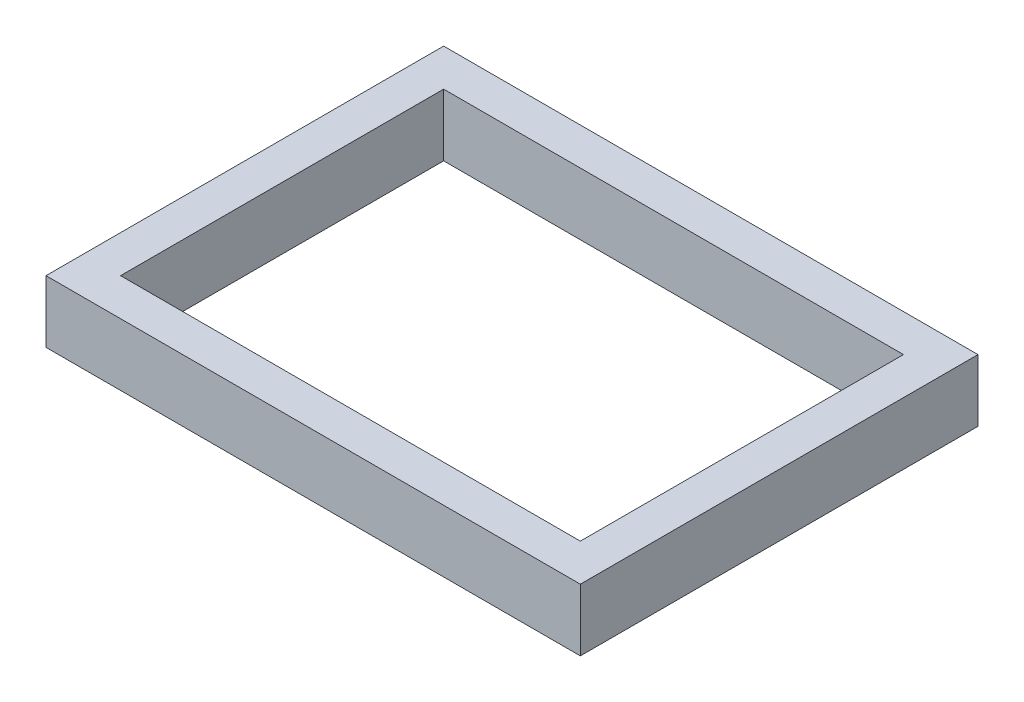
ISO-10303-21;
HEADER;
FILE_DESCRIPTION(('STEP AP214'),'2;1');
FILE_NAME('part.step','',(''),(''),'','','');
FILE_SCHEMA(('AUTOMOTIVE_DESIGN { 1 0 10303 214 1 1 1 1 }'));
ENDSEC;
DATA;
#1=APPLICATION_CONTEXT('core data for automotive mechanical design processes');
#2=APPLICATION_PROTOCOL_DEFINITION('international standard','automotive_design',2000,#1);
#3=PRODUCT_CONTEXT('',#1,'mechanical');
#4=PRODUCT('Part','Part','',(#3));
#5=PRODUCT_RELATED_PRODUCT_CATEGORY('part','',(#4));
#6=PRODUCT_DEFINITION_FORMATION('','',#4);
#7=PRODUCT_DEFINITION_CONTEXT('part definition',#1,'design');
#8=PRODUCT_DEFINITION('design','',#6,#7);
#9=PRODUCT_DEFINITION_SHAPE('','',#8);
#10=(LENGTH_UNIT() NAMED_UNIT(*) SI_UNIT(.MILLI.,.METRE.));
#11=(NAMED_UNIT(*) PLANE_ANGLE_UNIT() SI_UNIT($,.RADIAN.));
#12=(NAMED_UNIT(*) SI_UNIT($,.STERADIAN.) SOLID_ANGLE_UNIT());
#13=UNCERTAINTY_MEASURE_WITH_UNIT(LENGTH_MEASURE(1.E-05),#10,'distance_accuracy_value','');
#14=(GEOMETRIC_REPRESENTATION_CONTEXT(3) GLOBAL_UNCERTAINTY_ASSIGNED_CONTEXT((#13)) GLOBAL_UNIT_ASSIGNED_CONTEXT((#10,
#11,#12)) REPRESENTATION_CONTEXT('',''));
#15=CARTESIAN_POINT('',(0.,0.,0.));
#16=DIRECTION('',(0.,0.,1.));
#17=DIRECTION('',(1.,0.,0.));
#18=AXIS2_PLACEMENT_3D('',#15,#16,#17);
#19=CARTESIAN_POINT('',(0.,5.,0.));
#20=DIRECTION('',(0.,-1.,0.));
#21=DIRECTION('',(0.,0.,-1.));
#22=AXIS2_PLACEMENT_3D('',#19,#20,#21);
#23=PLANE('',#22);
#24=DIRECTION('',(0.,0.,1.));
#25=VECTOR('',#24,1.);
#26=CARTESIAN_POINT('',(-3.,5.,3.));
#27=LINE('',#26,#25);
#28=CARTESIAN_POINT('',(-3.,5.,-29.));
#29=VERTEX_POINT('',#28);
#30=CARTESIAN_POINT('',(-3.,5.,3.));
#31=VERTEX_POINT('',#30);
#32=EDGE_CURVE('E134',#29,#31,#27,.T.);
#33=ORIENTED_EDGE('',*,*,#32,.T.);
#34=DIRECTION('',(1.,0.,0.));
#35=VECTOR('',#34,1.);
#36=CARTESIAN_POINT('',(-3.,5.,3.));
#37=LINE('',#36,#35);
#38=CARTESIAN_POINT('',(40.,5.,3.));
#39=VERTEX_POINT('',#38);
#40=EDGE_CURVE('E137',#31,#39,#37,.T.);
#41=ORIENTED_EDGE('',*,*,#40,.T.);
#42=DIRECTION('',(0.,0.,-1.));
#43=VECTOR('',#42,1.);
#44=CARTESIAN_POINT('',(40.,5.,3.));
#45=LINE('',#44,#43);
#46=CARTESIAN_POINT('',(40.,5.,-29.));
#47=VERTEX_POINT('',#46);
#48=EDGE_CURVE('E140',#39,#47,#45,.T.);
#49=ORIENTED_EDGE('',*,*,#48,.T.);
#50=DIRECTION('',(-1.,0.,0.));
#51=VECTOR('',#50,1.);
#52=CARTESIAN_POINT('',(-3.,5.,-29.));
#53=LINE('',#52,#51);
#54=EDGE_CURVE('E142',#47,#29,#53,.T.);
#55=ORIENTED_EDGE('',*,*,#54,.T.);
#56=EDGE_LOOP('',(#33,#41,#49,#55));
#57=FACE_BOUND('',#56,.T.);
#58=DIRECTION('',(0.,0.,1.));
#59=VECTOR('',#58,1.);
#60=CARTESIAN_POINT('',(0.,5.,0.));
#61=LINE('',#60,#59);
#62=CARTESIAN_POINT('',(0.,5.,-26.));
#63=VERTEX_POINT('',#62);
#64=CARTESIAN_POINT('',(0.,5.,0.));
#65=VERTEX_POINT('',#64);
#66=EDGE_CURVE('E98',#63,#65,#61,.T.);
#67=ORIENTED_EDGE('',*,*,#66,.F.);
#68=DIRECTION('',(-1.,0.,0.));
#69=VECTOR('',#68,1.);
#70=CARTESIAN_POINT('',(0.,5.,-26.));
#71=LINE('',#70,#69);
#72=CARTESIAN_POINT('',(37.,5.,-26.));
#73=VERTEX_POINT('',#72);
#74=EDGE_CURVE('E120',#73,#63,#71,.T.);
#75=ORIENTED_EDGE('',*,*,#74,.F.);
#76=DIRECTION('',(0.,0.,-1.));
#77=VECTOR('',#76,1.);
#78=CARTESIAN_POINT('',(37.,5.,0.));
#79=LINE('',#78,#77);
#80=CARTESIAN_POINT('',(37.,5.,0.));
#81=VERTEX_POINT('',#80);
#82=EDGE_CURVE('E118',#81,#73,#79,.T.);
#83=ORIENTED_EDGE('',*,*,#82,.F.);
#84=DIRECTION('',(1.,0.,0.));
#85=VECTOR('',#84,1.);
#86=CARTESIAN_POINT('',(0.,5.,0.));
#87=LINE('',#86,#85);
#88=EDGE_CURVE('E106',#65,#81,#87,.T.);
#89=ORIENTED_EDGE('',*,*,#88,.F.);
#90=EDGE_LOOP('',(#67,#75,#83,#89));
#91=FACE_BOUND('',#90,.T.);
#92=ADVANCED_FACE('F33',(#57,#91),#23,.F.);
#93=CARTESIAN_POINT('',(0.,0.,0.));
#94=DIRECTION('',(0.,-1.,0.));
#95=DIRECTION('',(0.,0.,-1.));
#96=AXIS2_PLACEMENT_3D('',#93,#94,#95);
#97=PLANE('',#96);
#98=DIRECTION('',(0.,0.,1.));
#99=VECTOR('',#98,1.);
#100=CARTESIAN_POINT('',(-3.,0.,3.));
#101=LINE('',#100,#99);
#102=CARTESIAN_POINT('',(-3.,0.,-29.));
#103=VERTEX_POINT('',#102);
#104=CARTESIAN_POINT('',(-3.,0.,3.));
#105=VERTEX_POINT('',#104);
#106=EDGE_CURVE('E114',#103,#105,#101,.T.);
#107=ORIENTED_EDGE('',*,*,#106,.F.);
#108=DIRECTION('',(-1.,0.,0.));
#109=VECTOR('',#108,1.);
#110=CARTESIAN_POINT('',(-3.,0.,-29.));
#111=LINE('',#110,#109);
#112=CARTESIAN_POINT('',(40.,0.,-29.));
#113=VERTEX_POINT('',#112);
#114=EDGE_CURVE('E138',#113,#103,#111,.T.);
#115=ORIENTED_EDGE('',*,*,#114,.F.);
#116=DIRECTION('',(0.,0.,-1.));
#117=VECTOR('',#116,1.);
#118=CARTESIAN_POINT('',(40.,0.,3.));
#119=LINE('',#118,#117);
#120=CARTESIAN_POINT('',(40.,0.,3.));
#121=VERTEX_POINT('',#120);
#122=EDGE_CURVE('E149',#121,#113,#119,.T.);
#123=ORIENTED_EDGE('',*,*,#122,.F.);
#124=DIRECTION('',(1.,0.,0.));
#125=VECTOR('',#124,1.);
#126=CARTESIAN_POINT('',(-3.,0.,3.));
#127=LINE('',#126,#125);
#128=EDGE_CURVE('E147',#105,#121,#127,.T.);
#129=ORIENTED_EDGE('',*,*,#128,.F.);
#130=EDGE_LOOP('',(#107,#115,#123,#129));
#131=FACE_BOUND('',#130,.T.);
#132=DIRECTION('',(-1.,0.,0.));
#133=VECTOR('',#132,1.);
#134=CARTESIAN_POINT('',(0.,0.,-26.));
#135=LINE('',#134,#133);
#136=CARTESIAN_POINT('',(37.,0.,-26.));
#137=VERTEX_POINT('',#136);
#138=CARTESIAN_POINT('',(0.,0.,-26.));
#139=VERTEX_POINT('',#138);
#140=EDGE_CURVE('E107',#137,#139,#135,.T.);
#141=ORIENTED_EDGE('',*,*,#140,.T.);
#142=DIRECTION('',(0.,0.,1.));
#143=VECTOR('',#142,1.);
#144=CARTESIAN_POINT('',(0.,0.,0.));
#145=LINE('',#144,#143);
#146=CARTESIAN_POINT('',(0.,0.,0.));
#147=VERTEX_POINT('',#146);
#148=EDGE_CURVE('E56',#139,#147,#145,.T.);
#149=ORIENTED_EDGE('',*,*,#148,.T.);
#150=DIRECTION('',(1.,0.,0.));
#151=VECTOR('',#150,1.);
#152=CARTESIAN_POINT('',(0.,0.,0.));
#153=LINE('',#152,#151);
#154=CARTESIAN_POINT('',(37.,0.,0.));
#155=VERTEX_POINT('',#154);
#156=EDGE_CURVE('E113',#147,#155,#153,.T.);
#157=ORIENTED_EDGE('',*,*,#156,.T.);
#158=DIRECTION('',(0.,0.,-1.));
#159=VECTOR('',#158,1.);
#160=CARTESIAN_POINT('',(37.,0.,0.));
#161=LINE('',#160,#159);
#162=EDGE_CURVE('E126',#155,#137,#161,.T.);
#163=ORIENTED_EDGE('',*,*,#162,.T.);
#164=EDGE_LOOP('',(#141,#149,#157,#163));
#165=FACE_BOUND('',#164,.T.);
#166=ADVANCED_FACE('F167',(#131,#165),#97,.T.);
#167=CARTESIAN_POINT('',(-3.,5.,3.));
#168=DIRECTION('',(1.,0.,0.));
#169=DIRECTION('',(0.,0.,-1.));
#170=AXIS2_PLACEMENT_3D('',#167,#168,#169);
#171=PLANE('',#170);
#172=ORIENTED_EDGE('',*,*,#106,.T.);
#173=DIRECTION('',(0.,-1.,0.));
#174=VECTOR('',#173,1.);
#175=CARTESIAN_POINT('',(-3.,5.,3.));
#176=LINE('',#175,#174);
#177=EDGE_CURVE('E11',#31,#105,#176,.T.);
#178=ORIENTED_EDGE('',*,*,#177,.F.);
#179=ORIENTED_EDGE('',*,*,#32,.F.);
#180=DIRECTION('',(0.,-1.,0.));
#181=VECTOR('',#180,1.);
#182=CARTESIAN_POINT('',(-3.,5.,-29.));
#183=LINE('',#182,#181);
#184=EDGE_CURVE('E144',#29,#103,#183,.T.);
#185=ORIENTED_EDGE('',*,*,#184,.T.);
#186=EDGE_LOOP('',(#172,#178,#179,#185));
#187=FACE_BOUND('',#186,.T.);
#188=ADVANCED_FACE('F35',(#187),#171,.F.);
#189=CARTESIAN_POINT('',(-3.,5.,3.));
#190=DIRECTION('',(0.,0.,-1.));
#191=DIRECTION('',(-1.,0.,0.));
#192=AXIS2_PLACEMENT_3D('',#189,#190,#191);
#193=PLANE('',#192);
#194=ORIENTED_EDGE('',*,*,#128,.T.);
#195=DIRECTION('',(0.,-1.,0.));
#196=VECTOR('',#195,1.);
#197=CARTESIAN_POINT('',(40.,5.,3.));
#198=LINE('',#197,#196);
#199=EDGE_CURVE('E41',#39,#121,#198,.T.);
#200=ORIENTED_EDGE('',*,*,#199,.F.);
#201=ORIENTED_EDGE('',*,*,#40,.F.);
#202=ORIENTED_EDGE('',*,*,#177,.T.);
#203=EDGE_LOOP('',(#194,#200,#201,#202));
#204=FACE_BOUND('',#203,.T.);
#205=ADVANCED_FACE('F177',(#204),#193,.F.);
#206=CARTESIAN_POINT('',(40.,5.,3.));
#207=DIRECTION('',(-1.,0.,0.));
#208=DIRECTION('',(0.,0.,1.));
#209=AXIS2_PLACEMENT_3D('',#206,#207,#208);
#210=PLANE('',#209);
#211=ORIENTED_EDGE('',*,*,#122,.T.);
#212=DIRECTION('',(0.,-1.,0.));
#213=VECTOR('',#212,1.);
#214=CARTESIAN_POINT('',(40.,5.,-29.));
#215=LINE('',#214,#213);
#216=EDGE_CURVE('E154',#47,#113,#215,.T.);
#217=ORIENTED_EDGE('',*,*,#216,.F.);
#218=ORIENTED_EDGE('',*,*,#48,.F.);
#219=ORIENTED_EDGE('',*,*,#199,.T.);
#220=EDGE_LOOP('',(#211,#217,#218,#219));
#221=FACE_BOUND('',#220,.T.);
#222=ADVANCED_FACE('F161',(#221),#210,.F.);
#223=CARTESIAN_POINT('',(-3.,5.,-29.));
#224=DIRECTION('',(0.,0.,1.));
#225=DIRECTION('',(1.,0.,0.));
#226=AXIS2_PLACEMENT_3D('',#223,#224,#225);
#227=PLANE('',#226);
#228=ORIENTED_EDGE('',*,*,#114,.T.);
#229=ORIENTED_EDGE('',*,*,#184,.F.);
#230=ORIENTED_EDGE('',*,*,#54,.F.);
#231=ORIENTED_EDGE('',*,*,#216,.T.);
#232=EDGE_LOOP('',(#228,#229,#230,#231));
#233=FACE_BOUND('',#232,.T.);
#234=ADVANCED_FACE('F171',(#233),#227,.F.);
#235=CARTESIAN_POINT('',(0.,5.,0.));
#236=DIRECTION('',(1.,0.,0.));
#237=DIRECTION('',(0.,0.,-1.));
#238=AXIS2_PLACEMENT_3D('',#235,#236,#237);
#239=PLANE('',#238);
#240=ORIENTED_EDGE('',*,*,#148,.F.);
#241=DIRECTION('',(0.,-1.,0.));
#242=VECTOR('',#241,1.);
#243=CARTESIAN_POINT('',(0.,5.,-26.));
#244=LINE('',#243,#242);
#245=EDGE_CURVE('E102',#63,#139,#244,.T.);
#246=ORIENTED_EDGE('',*,*,#245,.F.);
#247=ORIENTED_EDGE('',*,*,#66,.T.);
#248=DIRECTION('',(0.,-1.,0.));
#249=VECTOR('',#248,1.);
#250=CARTESIAN_POINT('',(0.,5.,0.));
#251=LINE('',#250,#249);
#252=EDGE_CURVE('E101',#65,#147,#251,.T.);
#253=ORIENTED_EDGE('',*,*,#252,.T.);
#254=EDGE_LOOP('',(#240,#246,#247,#253));
#255=FACE_BOUND('',#254,.T.);
#256=ADVANCED_FACE('F100',(#255),#239,.T.);
#257=CARTESIAN_POINT('',(0.,5.,0.));
#258=DIRECTION('',(0.,0.,-1.));
#259=DIRECTION('',(-1.,0.,0.));
#260=AXIS2_PLACEMENT_3D('',#257,#258,#259);
#261=PLANE('',#260);
#262=ORIENTED_EDGE('',*,*,#156,.F.);
#263=ORIENTED_EDGE('',*,*,#252,.F.);
#264=ORIENTED_EDGE('',*,*,#88,.T.);
#265=DIRECTION('',(0.,-1.,0.));
#266=VECTOR('',#265,1.);
#267=CARTESIAN_POINT('',(37.,5.,0.));
#268=LINE('',#267,#266);
#269=EDGE_CURVE('E115',#81,#155,#268,.T.);
#270=ORIENTED_EDGE('',*,*,#269,.T.);
#271=EDGE_LOOP('',(#262,#263,#264,#270));
#272=FACE_BOUND('',#271,.T.);
#273=ADVANCED_FACE('F110',(#272),#261,.T.);
#274=CARTESIAN_POINT('',(37.,5.,0.));
#275=DIRECTION('',(-1.,0.,0.));
#276=DIRECTION('',(0.,0.,1.));
#277=AXIS2_PLACEMENT_3D('',#274,#275,#276);
#278=PLANE('',#277);
#279=ORIENTED_EDGE('',*,*,#162,.F.);
#280=ORIENTED_EDGE('',*,*,#269,.F.);
#281=ORIENTED_EDGE('',*,*,#82,.T.);
#282=DIRECTION('',(0.,-1.,0.));
#283=VECTOR('',#282,1.);
#284=CARTESIAN_POINT('',(37.,5.,-26.));
#285=LINE('',#284,#283);
#286=EDGE_CURVE('E48',#73,#137,#285,.T.);
#287=ORIENTED_EDGE('',*,*,#286,.T.);
#288=EDGE_LOOP('',(#279,#280,#281,#287));
#289=FACE_BOUND('',#288,.T.);
#290=ADVANCED_FACE('F200',(#289),#278,.T.);
#291=CARTESIAN_POINT('',(0.,5.,-26.));
#292=DIRECTION('',(0.,0.,1.));
#293=DIRECTION('',(1.,0.,0.));
#294=AXIS2_PLACEMENT_3D('',#291,#292,#293);
#295=PLANE('',#294);
#296=ORIENTED_EDGE('',*,*,#140,.F.);
#297=ORIENTED_EDGE('',*,*,#286,.F.);
#298=ORIENTED_EDGE('',*,*,#74,.T.);
#299=ORIENTED_EDGE('',*,*,#245,.T.);
#300=EDGE_LOOP('',(#296,#297,#298,#299));
#301=FACE_BOUND('',#300,.T.);
#302=ADVANCED_FACE('F204',(#301),#295,.T.);
#303=CLOSED_SHELL('',(#92,#166,#188,#205,#222,#234,#256,#273,#290,#302));
#304=MANIFOLD_SOLID_BREP('B2',#303);
#305=ADVANCED_BREP_SHAPE_REPRESENTATION('',(#18,#304),#14);
#306=SHAPE_DEFINITION_REPRESENTATION(#9,#305);
ENDSEC;
END-ISO-10303-21;
